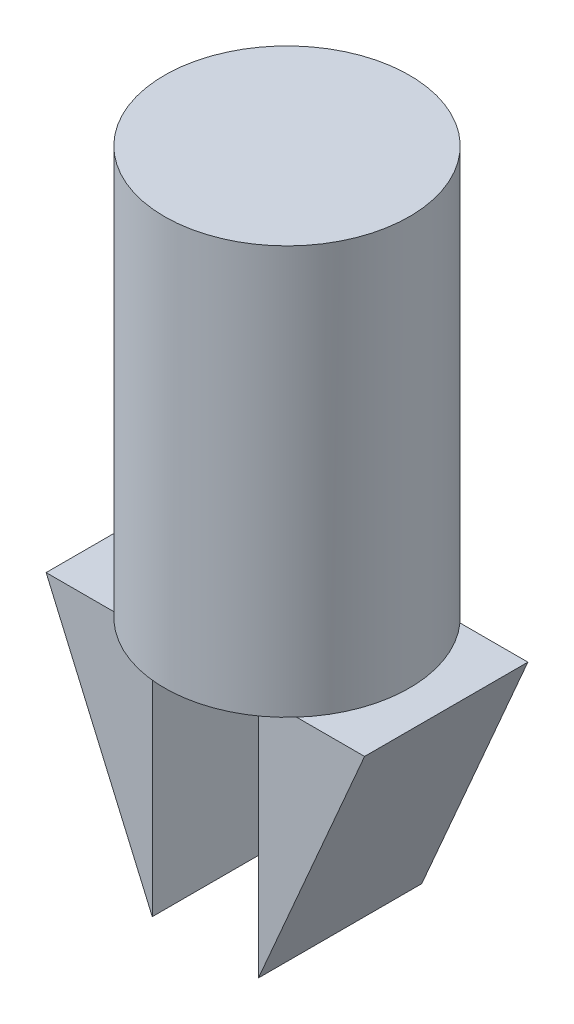
ISO-10303-21;
HEADER;
FILE_DESCRIPTION(('STEP AP214'),'2;1');
FILE_NAME('part.step','',(''),(''),'','','');
FILE_SCHEMA(('AUTOMOTIVE_DESIGN { 1 0 10303 214 1 1 1 1 }'));
ENDSEC;
DATA;
#1=APPLICATION_CONTEXT('core data for automotive mechanical design processes');
#2=APPLICATION_PROTOCOL_DEFINITION('international standard','automotive_design',2000,#1);
#3=PRODUCT_CONTEXT('',#1,'mechanical');
#4=PRODUCT('Part','Part','',(#3));
#5=PRODUCT_RELATED_PRODUCT_CATEGORY('part','',(#4));
#6=PRODUCT_DEFINITION_FORMATION('','',#4);
#7=PRODUCT_DEFINITION_CONTEXT('part definition',#1,'design');
#8=PRODUCT_DEFINITION('design','',#6,#7);
#9=PRODUCT_DEFINITION_SHAPE('','',#8);
#10=(LENGTH_UNIT() NAMED_UNIT(*) SI_UNIT(.MILLI.,.METRE.));
#11=(NAMED_UNIT(*) PLANE_ANGLE_UNIT() SI_UNIT($,.RADIAN.));
#12=(NAMED_UNIT(*) SI_UNIT($,.STERADIAN.) SOLID_ANGLE_UNIT());
#13=UNCERTAINTY_MEASURE_WITH_UNIT(LENGTH_MEASURE(1.E-05),#10,'distance_accuracy_value','');
#14=(GEOMETRIC_REPRESENTATION_CONTEXT(3) GLOBAL_UNCERTAINTY_ASSIGNED_CONTEXT((#13)) GLOBAL_UNIT_ASSIGNED_CONTEXT((#10,
#11,#12)) REPRESENTATION_CONTEXT('',''));
#15=CARTESIAN_POINT('',(0.,0.,0.));
#16=DIRECTION('',(0.,0.,1.));
#17=DIRECTION('',(1.,0.,0.));
#18=AXIS2_PLACEMENT_3D('',#15,#16,#17);
#19=CARTESIAN_POINT('',(0.,50.,0.));
#20=DIRECTION('',(0.,-1.,0.));
#21=DIRECTION('',(0.,0.,-1.));
#22=AXIS2_PLACEMENT_3D('',#19,#20,#21);
#23=CYLINDRICAL_SURFACE('',#22,15.);
#24=CARTESIAN_POINT('',(0.,50.,0.));
#25=DIRECTION('',(0.,1.,0.));
#26=DIRECTION('',(0.,0.,1.));
#27=AXIS2_PLACEMENT_3D('',#24,#25,#26);
#28=CIRCLE('',#27,15.);
#29=CARTESIAN_POINT('',(0.,50.,15.));
#30=VERTEX_POINT('',#29);
#31=EDGE_CURVE('E11',#30,#30,#28,.T.);
#32=ORIENTED_EDGE('',*,*,#31,.F.);
#33=EDGE_LOOP('',(#32));
#34=FACE_BOUND('',#33,.T.);
#35=CARTESIAN_POINT('',(0.,0.,0.));
#36=DIRECTION('',(0.,1.,0.));
#37=DIRECTION('',(0.,0.,1.));
#38=AXIS2_PLACEMENT_3D('',#35,#36,#37);
#39=CIRCLE('',#38,15.);
#40=CARTESIAN_POINT('',(-11.1803398874989,-3.67395217428703E-11,-10.));
#41=VERTEX_POINT('',#40);
#42=CARTESIAN_POINT('',(-11.1803398874989,-3.67395217428703E-11,10.));
#43=VERTEX_POINT('',#42);
#44=EDGE_CURVE('E50',#41,#43,#39,.T.);
#45=ORIENTED_EDGE('',*,*,#44,.T.);
#46=CARTESIAN_POINT('',(11.1803398874989,0.,10.));
#47=VERTEX_POINT('',#46);
#48=EDGE_CURVE('E194',#43,#47,#39,.T.);
#49=ORIENTED_EDGE('',*,*,#48,.T.);
#50=CARTESIAN_POINT('',(11.1803398874989,-3.6736783349379E-11,-10.));
#51=VERTEX_POINT('',#50);
#52=EDGE_CURVE('E189',#47,#51,#39,.T.);
#53=ORIENTED_EDGE('',*,*,#52,.T.);
#54=EDGE_CURVE('E185',#51,#41,#39,.T.);
#55=ORIENTED_EDGE('',*,*,#54,.T.);
#56=EDGE_LOOP('',(#45,#49,#53,#55));
#57=FACE_BOUND('',#56,.T.);
#58=ADVANCED_FACE('F47',(#34,#57),#23,.T.);
#59=CARTESIAN_POINT('',(0.,50.,0.));
#60=DIRECTION('',(0.,1.,0.));
#61=DIRECTION('',(0.,0.,1.));
#62=AXIS2_PLACEMENT_3D('',#59,#60,#61);
#63=PLANE('',#62);
#64=ORIENTED_EDGE('',*,*,#31,.T.);
#65=EDGE_LOOP('',(#64));
#66=FACE_BOUND('',#65,.T.);
#67=ADVANCED_FACE('F222',(#66),#63,.T.);
#68=CARTESIAN_POINT('',(0.,0.,0.));
#69=DIRECTION('',(0.,1.,0.));
#70=DIRECTION('',(0.,0.,1.));
#71=AXIS2_PLACEMENT_3D('',#68,#69,#70);
#72=PLANE('',#71);
#73=DIRECTION('',(0.,0.,-1.));
#74=VECTOR('',#73,1.);
#75=CARTESIAN_POINT('',(6.5,-3.67382162901945E-11,10.));
#76=LINE('',#75,#74);
#77=CARTESIAN_POINT('',(6.5,0.,10.));
#78=VERTEX_POINT('',#77);
#79=CARTESIAN_POINT('',(6.5,0.,-10.));
#80=VERTEX_POINT('',#79);
#81=EDGE_CURVE('E62',#78,#80,#76,.T.);
#82=ORIENTED_EDGE('',*,*,#81,.F.);
#83=DIRECTION('',(1.,0.,0.));
#84=VECTOR('',#83,1.);
#85=CARTESIAN_POINT('',(6.5,-3.67382162901945E-11,10.));
#86=LINE('',#85,#84);
#87=EDGE_CURVE('E146',#78,#47,#86,.T.);
#88=ORIENTED_EDGE('',*,*,#87,.T.);
#89=ORIENTED_EDGE('',*,*,#48,.F.);
#90=DIRECTION('',(-1.,0.,0.));
#91=VECTOR('',#90,1.);
#92=CARTESIAN_POINT('',(0.,-3.67402063412431E-11,10.));
#93=LINE('',#92,#91);
#94=CARTESIAN_POINT('',(-6.5,-3.67398083310334E-11,10.));
#95=VERTEX_POINT('',#94);
#96=EDGE_CURVE('E163',#95,#43,#93,.T.);
#97=ORIENTED_EDGE('',*,*,#96,.F.);
#98=DIRECTION('',(0.,0.,-1.));
#99=VECTOR('',#98,1.);
#100=CARTESIAN_POINT('',(-6.5,-3.67398083310334E-11,10.));
#101=LINE('',#100,#99);
#102=CARTESIAN_POINT('',(-6.5,-3.67398083310334E-11,-10.));
#103=VERTEX_POINT('',#102);
#104=EDGE_CURVE('E178',#95,#103,#101,.T.);
#105=ORIENTED_EDGE('',*,*,#104,.T.);
#106=DIRECTION('',(-1.,0.,0.));
#107=VECTOR('',#106,1.);
#108=CARTESIAN_POINT('',(0.,-3.67402063412431E-11,-10.));
#109=LINE('',#108,#107);
#110=EDGE_CURVE('E159',#103,#41,#109,.T.);
#111=ORIENTED_EDGE('',*,*,#110,.T.);
#112=ORIENTED_EDGE('',*,*,#54,.F.);
#113=DIRECTION('',(1.,0.,0.));
#114=VECTOR('',#113,1.);
#115=CARTESIAN_POINT('',(6.5,-3.67382162901945E-11,-10.));
#116=LINE('',#115,#114);
#117=EDGE_CURVE('E67',#80,#51,#116,.T.);
#118=ORIENTED_EDGE('',*,*,#117,.F.);
#119=EDGE_LOOP('',(#82,#88,#89,#97,#105,#111,#112,#118));
#120=FACE_BOUND('',#119,.T.);
#121=ADVANCED_FACE('F228',(#120),#72,.F.);
#122=CARTESIAN_POINT('',(-16.4172123480022,-7.11412535080095,10.));
#123=DIRECTION('',(0.917555625309924,0.397607437634301,0.));
#124=DIRECTION('',(-0.397607437634301,0.917555625309924,0.));
#125=AXIS2_PLACEMENT_3D('',#122,#123,#124);
#126=PLANE('',#125);
#127=DIRECTION('',(0.397607437634301,-0.917555625309924,0.));
#128=VECTOR('',#127,1.);
#129=CARTESIAN_POINT('',(-16.4172123480022,-7.11412535080095,-10.));
#130=LINE('',#129,#128);
#131=CARTESIAN_POINT('',(-19.5,-3.67388411359748E-11,-10.));
#132=VERTEX_POINT('',#131);
#133=CARTESIAN_POINT('',(-6.49999999999999,-30.0000000000367,-10.));
#134=VERTEX_POINT('',#133);
#135=EDGE_CURVE('E136',#132,#134,#130,.T.);
#136=ORIENTED_EDGE('',*,*,#135,.T.);
#137=DIRECTION('',(0.,0.,-1.));
#138=VECTOR('',#137,1.);
#139=CARTESIAN_POINT('',(-6.49999999999999,-30.0000000000367,10.));
#140=LINE('',#139,#138);
#141=CARTESIAN_POINT('',(-6.49999999999999,-30.0000000000367,10.));
#142=VERTEX_POINT('',#141);
#143=EDGE_CURVE('E182',#142,#134,#140,.T.);
#144=ORIENTED_EDGE('',*,*,#143,.F.);
#145=DIRECTION('',(0.397607437634301,-0.917555625309924,0.));
#146=VECTOR('',#145,1.);
#147=CARTESIAN_POINT('',(-16.4172123480022,-7.11412535080095,10.));
#148=LINE('',#147,#146);
#149=CARTESIAN_POINT('',(-19.5,-3.67388411359748E-11,10.));
#150=VERTEX_POINT('',#149);
#151=EDGE_CURVE('E154',#150,#142,#148,.T.);
#152=ORIENTED_EDGE('',*,*,#151,.F.);
#153=DIRECTION('',(0.,0.,-1.));
#154=VECTOR('',#153,1.);
#155=CARTESIAN_POINT('',(-19.5,-3.67388411359748E-11,10.));
#156=LINE('',#155,#154);
#157=EDGE_CURVE('E166',#150,#132,#156,.T.);
#158=ORIENTED_EDGE('',*,*,#157,.T.);
#159=EDGE_LOOP('',(#136,#144,#152,#158));
#160=FACE_BOUND('',#159,.T.);
#161=ADVANCED_FACE('F234',(#160),#126,.F.);
#162=CARTESIAN_POINT('',(-6.5,0.,10.));
#163=DIRECTION('',(-1.,0.,0.));
#164=DIRECTION('',(0.,-1.,0.));
#165=AXIS2_PLACEMENT_3D('',#162,#163,#164);
#166=PLANE('',#165);
#167=DIRECTION('',(0.,1.,0.));
#168=VECTOR('',#167,1.);
#169=CARTESIAN_POINT('',(-6.5,0.,-10.));
#170=LINE('',#169,#168);
#171=EDGE_CURVE('E142',#134,#103,#170,.T.);
#172=ORIENTED_EDGE('',*,*,#171,.T.);
#173=ORIENTED_EDGE('',*,*,#104,.F.);
#174=DIRECTION('',(0.,1.,0.));
#175=VECTOR('',#174,1.);
#176=CARTESIAN_POINT('',(-6.5,0.,10.));
#177=LINE('',#176,#175);
#178=EDGE_CURVE('E158',#142,#95,#177,.T.);
#179=ORIENTED_EDGE('',*,*,#178,.F.);
#180=ORIENTED_EDGE('',*,*,#143,.T.);
#181=EDGE_LOOP('',(#172,#173,#179,#180));
#182=FACE_BOUND('',#181,.T.);
#183=ADVANCED_FACE('F238',(#182),#166,.F.);
#184=CARTESIAN_POINT('',(0.,-3.67402063412431E-11,10.));
#185=DIRECTION('',(0.,-1.,0.));
#186=DIRECTION('',(1.,0.,0.));
#187=AXIS2_PLACEMENT_3D('',#184,#185,#186);
#188=PLANE('',#187);
#189=ORIENTED_EDGE('',*,*,#44,.F.);
#190=EDGE_CURVE('E171',#41,#132,#109,.T.);
#191=ORIENTED_EDGE('',*,*,#190,.T.);
#192=ORIENTED_EDGE('',*,*,#157,.F.);
#193=EDGE_CURVE('E162',#43,#150,#93,.T.);
#194=ORIENTED_EDGE('',*,*,#193,.F.);
#195=EDGE_LOOP('',(#189,#191,#192,#194));
#196=FACE_BOUND('',#195,.T.);
#197=ADVANCED_FACE('F242',(#196),#188,.F.);
#198=CARTESIAN_POINT('',(0.,0.,10.));
#199=DIRECTION('',(0.,0.,1.));
#200=DIRECTION('',(1.,0.,0.));
#201=AXIS2_PLACEMENT_3D('',#198,#199,#200);
#202=PLANE('',#201);
#203=ORIENTED_EDGE('',*,*,#151,.T.);
#204=ORIENTED_EDGE('',*,*,#178,.T.);
#205=ORIENTED_EDGE('',*,*,#96,.T.);
#206=ORIENTED_EDGE('',*,*,#193,.T.);
#207=EDGE_LOOP('',(#203,#204,#205,#206));
#208=FACE_BOUND('',#207,.T.);
#209=ADVANCED_FACE('F245',(#208),#202,.T.);
#210=CARTESIAN_POINT('',(0.,0.,-10.));
#211=DIRECTION('',(0.,0.,1.));
#212=DIRECTION('',(1.,0.,0.));
#213=AXIS2_PLACEMENT_3D('',#210,#211,#212);
#214=PLANE('',#213);
#215=ORIENTED_EDGE('',*,*,#135,.F.);
#216=ORIENTED_EDGE('',*,*,#190,.F.);
#217=ORIENTED_EDGE('',*,*,#110,.F.);
#218=ORIENTED_EDGE('',*,*,#171,.F.);
#219=EDGE_LOOP('',(#215,#216,#217,#218));
#220=FACE_BOUND('',#219,.T.);
#221=ADVANCED_FACE('F247',(#220),#214,.F.);
#222=CARTESIAN_POINT('',(19.5,-3.67342361880973E-11,10.));
#223=DIRECTION('',(0.917555625309924,-0.397607437634301,0.));
#224=DIRECTION('',(0.397607437634301,0.917555625309924,0.));
#225=AXIS2_PLACEMENT_3D('',#222,#223,#224);
#226=PLANE('',#225);
#227=DIRECTION('',(-0.3976074376343,-0.917555625309924,0.));
#228=VECTOR('',#227,1.);
#229=CARTESIAN_POINT('',(19.5,-3.67342361880973E-11,-10.));
#230=LINE('',#229,#228);
#231=CARTESIAN_POINT('',(19.5,-3.67342361880973E-11,-10.));
#232=VERTEX_POINT('',#231);
#233=CARTESIAN_POINT('',(6.5,-30.0000000000367,-10.));
#234=VERTEX_POINT('',#233);
#235=EDGE_CURVE('E116',#232,#234,#230,.T.);
#236=ORIENTED_EDGE('',*,*,#235,.F.);
#237=DIRECTION('',(0.,0.,-1.));
#238=VECTOR('',#237,1.);
#239=CARTESIAN_POINT('',(19.5,-3.67342361880973E-11,10.));
#240=LINE('',#239,#238);
#241=CARTESIAN_POINT('',(19.5,-3.67342361880973E-11,10.));
#242=VERTEX_POINT('',#241);
#243=EDGE_CURVE('E123',#242,#232,#240,.T.);
#244=ORIENTED_EDGE('',*,*,#243,.F.);
#245=DIRECTION('',(-0.3976074376343,-0.917555625309924,0.));
#246=VECTOR('',#245,1.);
#247=CARTESIAN_POINT('',(19.5,-3.67342361880973E-11,10.));
#248=LINE('',#247,#246);
#249=CARTESIAN_POINT('',(6.5,-30.0000000000367,10.));
#250=VERTEX_POINT('',#249);
#251=EDGE_CURVE('E120',#242,#250,#248,.T.);
#252=ORIENTED_EDGE('',*,*,#251,.T.);
#253=DIRECTION('',(0.,0.,-1.));
#254=VECTOR('',#253,1.);
#255=CARTESIAN_POINT('',(6.5,-30.0000000000367,10.));
#256=LINE('',#255,#254);
#257=EDGE_CURVE('E133',#250,#234,#256,.T.);
#258=ORIENTED_EDGE('',*,*,#257,.T.);
#259=EDGE_LOOP('',(#236,#244,#252,#258));
#260=FACE_BOUND('',#259,.T.);
#261=ADVANCED_FACE('F132',(#260),#226,.T.);
#262=CARTESIAN_POINT('',(6.5,-3.67382162901945E-11,10.));
#263=DIRECTION('',(0.,1.,0.));
#264=DIRECTION('',(-1.,0.,0.));
#265=AXIS2_PLACEMENT_3D('',#262,#263,#264);
#266=PLANE('',#265);
#267=ORIENTED_EDGE('',*,*,#52,.F.);
#268=EDGE_CURVE('E126',#47,#242,#86,.T.);
#269=ORIENTED_EDGE('',*,*,#268,.T.);
#270=ORIENTED_EDGE('',*,*,#243,.T.);
#271=EDGE_CURVE('E111',#51,#232,#116,.T.);
#272=ORIENTED_EDGE('',*,*,#271,.F.);
#273=EDGE_LOOP('',(#267,#269,#270,#272));
#274=FACE_BOUND('',#273,.T.);
#275=ADVANCED_FACE('F124',(#274),#266,.T.);
#276=CARTESIAN_POINT('',(6.5,-30.0000000000367,10.));
#277=DIRECTION('',(-1.,0.,0.));
#278=DIRECTION('',(0.,0.,1.));
#279=AXIS2_PLACEMENT_3D('',#276,#277,#278);
#280=PLANE('',#279);
#281=DIRECTION('',(0.,1.,0.));
#282=VECTOR('',#281,1.);
#283=CARTESIAN_POINT('',(6.5,-30.0000000000367,-10.));
#284=LINE('',#283,#282);
#285=EDGE_CURVE('E137',#234,#80,#284,.T.);
#286=ORIENTED_EDGE('',*,*,#285,.F.);
#287=ORIENTED_EDGE('',*,*,#257,.F.);
#288=DIRECTION('',(0.,1.,0.));
#289=VECTOR('',#288,1.);
#290=CARTESIAN_POINT('',(6.5,-30.0000000000367,10.));
#291=LINE('',#290,#289);
#292=EDGE_CURVE('E149',#250,#78,#291,.T.);
#293=ORIENTED_EDGE('',*,*,#292,.T.);
#294=ORIENTED_EDGE('',*,*,#81,.T.);
#295=EDGE_LOOP('',(#286,#287,#293,#294));
#296=FACE_BOUND('',#295,.T.);
#297=ADVANCED_FACE('F211',(#296),#280,.T.);
#298=CARTESIAN_POINT('',(0.,0.,10.));
#299=DIRECTION('',(0.,0.,1.));
#300=DIRECTION('',(1.,0.,0.));
#301=AXIS2_PLACEMENT_3D('',#298,#299,#300);
#302=PLANE('',#301);
#303=ORIENTED_EDGE('',*,*,#251,.F.);
#304=ORIENTED_EDGE('',*,*,#268,.F.);
#305=ORIENTED_EDGE('',*,*,#87,.F.);
#306=ORIENTED_EDGE('',*,*,#292,.F.);
#307=EDGE_LOOP('',(#303,#304,#305,#306));
#308=FACE_BOUND('',#307,.T.);
#309=ADVANCED_FACE('F202',(#308),#302,.T.);
#310=CARTESIAN_POINT('',(0.,0.,-10.));
#311=DIRECTION('',(0.,0.,1.));
#312=DIRECTION('',(1.,0.,0.));
#313=AXIS2_PLACEMENT_3D('',#310,#311,#312);
#314=PLANE('',#313);
#315=ORIENTED_EDGE('',*,*,#235,.T.);
#316=ORIENTED_EDGE('',*,*,#285,.T.);
#317=ORIENTED_EDGE('',*,*,#117,.T.);
#318=ORIENTED_EDGE('',*,*,#271,.T.);
#319=EDGE_LOOP('',(#315,#316,#317,#318));
#320=FACE_BOUND('',#319,.T.);
#321=ADVANCED_FACE('F113',(#320),#314,.F.);
#322=CLOSED_SHELL('',(#58,#67,#121,#161,#183,#197,#209,#221,#261,#275,#297,#309,#321));
#323=MANIFOLD_SOLID_BREP('B2',#322);
#324=ADVANCED_BREP_SHAPE_REPRESENTATION('',(#18,#323),#14);
#325=SHAPE_DEFINITION_REPRESENTATION(#9,#324);
ENDSEC;
END-ISO-10303-21;
